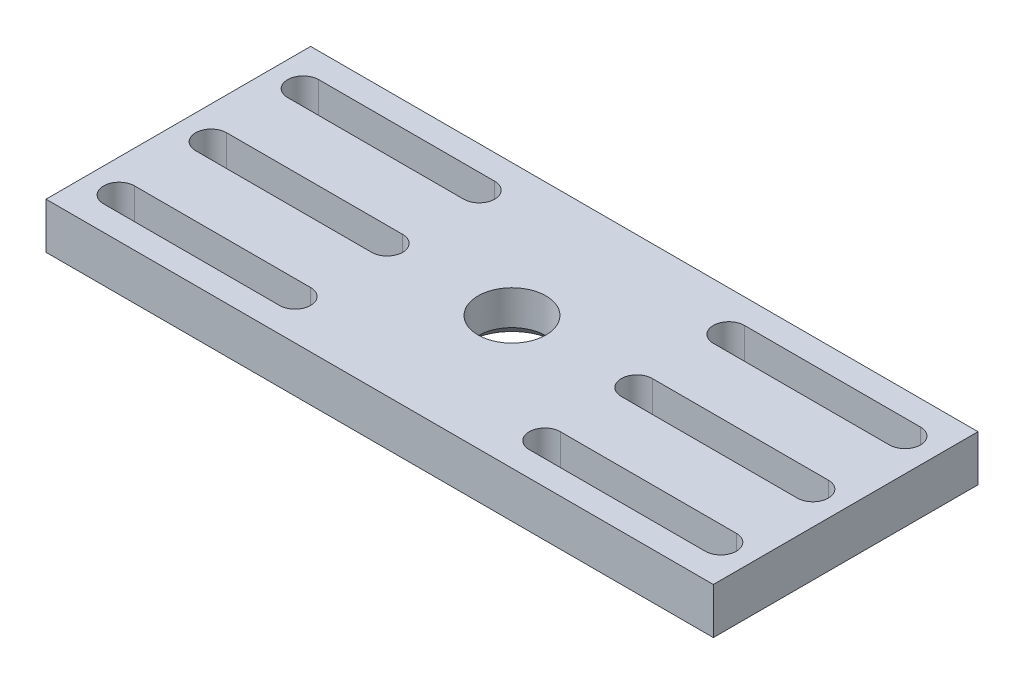
ISO-10303-21;
HEADER;
FILE_DESCRIPTION(('STEP AP214'),'2;1');
FILE_NAME('part.step','',(''),(''),'','','');
FILE_SCHEMA(('AUTOMOTIVE_DESIGN { 1 0 10303 214 1 1 1 1 }'));
ENDSEC;
DATA;
#1=APPLICATION_CONTEXT('core data for automotive mechanical design processes');
#2=APPLICATION_PROTOCOL_DEFINITION('international standard','automotive_design',2000,#1);
#3=PRODUCT_CONTEXT('',#1,'mechanical');
#4=PRODUCT('Part','Part','',(#3));
#5=PRODUCT_RELATED_PRODUCT_CATEGORY('part','',(#4));
#6=PRODUCT_DEFINITION_FORMATION('','',#4);
#7=PRODUCT_DEFINITION_CONTEXT('part definition',#1,'design');
#8=PRODUCT_DEFINITION('design','',#6,#7);
#9=PRODUCT_DEFINITION_SHAPE('','',#8);
#10=(LENGTH_UNIT() NAMED_UNIT(*) SI_UNIT(.MILLI.,.METRE.));
#11=(NAMED_UNIT(*) PLANE_ANGLE_UNIT() SI_UNIT($,.RADIAN.));
#12=(NAMED_UNIT(*) SI_UNIT($,.STERADIAN.) SOLID_ANGLE_UNIT());
#13=UNCERTAINTY_MEASURE_WITH_UNIT(LENGTH_MEASURE(1.E-05),#10,'distance_accuracy_value','');
#14=(GEOMETRIC_REPRESENTATION_CONTEXT(3) GLOBAL_UNCERTAINTY_ASSIGNED_CONTEXT((#13)) GLOBAL_UNIT_ASSIGNED_CONTEXT((#10,
#11,#12)) REPRESENTATION_CONTEXT('',''));
#15=CARTESIAN_POINT('',(0.,0.,0.));
#16=DIRECTION('',(0.,0.,1.));
#17=DIRECTION('',(1.,0.,0.));
#18=AXIS2_PLACEMENT_3D('',#15,#16,#17);
#19=CARTESIAN_POINT('',(145.,20.,57.5));
#20=DIRECTION('',(-1.,0.,0.));
#21=DIRECTION('',(0.,0.,1.));
#22=AXIS2_PLACEMENT_3D('',#19,#20,#21);
#23=PLANE('',#22);
#24=DIRECTION('',(0.,0.,-1.));
#25=VECTOR('',#24,1.);
#26=CARTESIAN_POINT('',(145.,0.,57.5));
#27=LINE('',#26,#25);
#28=CARTESIAN_POINT('',(145.,0.,57.5));
#29=VERTEX_POINT('',#28);
#30=CARTESIAN_POINT('',(145.,0.,-57.5));
#31=VERTEX_POINT('',#30);
#32=EDGE_CURVE('E494',#29,#31,#27,.T.);
#33=ORIENTED_EDGE('',*,*,#32,.T.);
#34=DIRECTION('',(0.,-1.,0.));
#35=VECTOR('',#34,1.);
#36=CARTESIAN_POINT('',(145.,20.,-57.5));
#37=LINE('',#36,#35);
#38=CARTESIAN_POINT('',(145.,20.,-57.5));
#39=VERTEX_POINT('',#38);
#40=EDGE_CURVE('E541',#39,#31,#37,.T.);
#41=ORIENTED_EDGE('',*,*,#40,.F.);
#42=DIRECTION('',(0.,0.,-1.));
#43=VECTOR('',#42,1.);
#44=CARTESIAN_POINT('',(145.,20.,57.5));
#45=LINE('',#44,#43);
#46=CARTESIAN_POINT('',(145.,20.,57.5));
#47=VERTEX_POINT('',#46);
#48=EDGE_CURVE('E504',#47,#39,#45,.T.);
#49=ORIENTED_EDGE('',*,*,#48,.F.);
#50=DIRECTION('',(0.,-1.,0.));
#51=VECTOR('',#50,1.);
#52=CARTESIAN_POINT('',(145.,20.,57.5));
#53=LINE('',#52,#51);
#54=EDGE_CURVE('E518',#47,#29,#53,.T.);
#55=ORIENTED_EDGE('',*,*,#54,.T.);
#56=EDGE_LOOP('',(#33,#41,#49,#55));
#57=FACE_BOUND('',#56,.T.);
#58=ADVANCED_FACE('F41',(#57),#23,.F.);
#59=CARTESIAN_POINT('',(-145.,20.,-57.5));
#60=DIRECTION('',(0.,0.,1.));
#61=DIRECTION('',(1.,0.,0.));
#62=AXIS2_PLACEMENT_3D('',#59,#60,#61);
#63=PLANE('',#62);
#64=DIRECTION('',(-1.,0.,0.));
#65=VECTOR('',#64,1.);
#66=CARTESIAN_POINT('',(-145.,0.,-57.5));
#67=LINE('',#66,#65);
#68=CARTESIAN_POINT('',(-145.,0.,-57.5));
#69=VERTEX_POINT('',#68);
#70=EDGE_CURVE('E522',#31,#69,#67,.T.);
#71=ORIENTED_EDGE('',*,*,#70,.T.);
#72=DIRECTION('',(0.,-1.,0.));
#73=VECTOR('',#72,1.);
#74=CARTESIAN_POINT('',(-145.,20.,-57.5));
#75=LINE('',#74,#73);
#76=CARTESIAN_POINT('',(-145.,20.,-57.5));
#77=VERTEX_POINT('',#76);
#78=EDGE_CURVE('E537',#77,#69,#75,.T.);
#79=ORIENTED_EDGE('',*,*,#78,.F.);
#80=DIRECTION('',(-1.,0.,0.));
#81=VECTOR('',#80,1.);
#82=CARTESIAN_POINT('',(-145.,20.,-57.5));
#83=LINE('',#82,#81);
#84=EDGE_CURVE('E508',#39,#77,#83,.T.);
#85=ORIENTED_EDGE('',*,*,#84,.F.);
#86=ORIENTED_EDGE('',*,*,#40,.T.);
#87=EDGE_LOOP('',(#71,#79,#85,#86));
#88=FACE_BOUND('',#87,.T.);
#89=ADVANCED_FACE('F561',(#88),#63,.F.);
#90=CARTESIAN_POINT('',(-145.,20.,57.5));
#91=DIRECTION('',(1.,0.,0.));
#92=DIRECTION('',(0.,0.,-1.));
#93=AXIS2_PLACEMENT_3D('',#90,#91,#92);
#94=PLANE('',#93);
#95=DIRECTION('',(0.,0.,1.));
#96=VECTOR('',#95,1.);
#97=CARTESIAN_POINT('',(-145.,0.,57.5));
#98=LINE('',#97,#96);
#99=CARTESIAN_POINT('',(-145.,0.,57.5));
#100=VERTEX_POINT('',#99);
#101=EDGE_CURVE('E525',#69,#100,#98,.T.);
#102=ORIENTED_EDGE('',*,*,#101,.T.);
#103=DIRECTION('',(0.,-1.,0.));
#104=VECTOR('',#103,1.);
#105=CARTESIAN_POINT('',(-145.,20.,57.5));
#106=LINE('',#105,#104);
#107=CARTESIAN_POINT('',(-145.,20.,57.5));
#108=VERTEX_POINT('',#107);
#109=EDGE_CURVE('E533',#108,#100,#106,.T.);
#110=ORIENTED_EDGE('',*,*,#109,.F.);
#111=DIRECTION('',(0.,0.,1.));
#112=VECTOR('',#111,1.);
#113=CARTESIAN_POINT('',(-145.,20.,57.5));
#114=LINE('',#113,#112);
#115=EDGE_CURVE('E512',#77,#108,#114,.T.);
#116=ORIENTED_EDGE('',*,*,#115,.F.);
#117=ORIENTED_EDGE('',*,*,#78,.T.);
#118=EDGE_LOOP('',(#102,#110,#116,#117));
#119=FACE_BOUND('',#118,.T.);
#120=ADVANCED_FACE('F566',(#119),#94,.F.);
#121=CARTESIAN_POINT('',(-145.,20.,57.5));
#122=DIRECTION('',(0.,0.,-1.));
#123=DIRECTION('',(-1.,0.,0.));
#124=AXIS2_PLACEMENT_3D('',#121,#122,#123);
#125=PLANE('',#124);
#126=DIRECTION('',(1.,0.,0.));
#127=VECTOR('',#126,1.);
#128=CARTESIAN_POINT('',(-145.,0.,57.5));
#129=LINE('',#128,#127);
#130=EDGE_CURVE('E509',#100,#29,#129,.T.);
#131=ORIENTED_EDGE('',*,*,#130,.T.);
#132=ORIENTED_EDGE('',*,*,#54,.F.);
#133=DIRECTION('',(1.,0.,0.));
#134=VECTOR('',#133,1.);
#135=CARTESIAN_POINT('',(-145.,20.,57.5));
#136=LINE('',#135,#134);
#137=EDGE_CURVE('E515',#108,#47,#136,.T.);
#138=ORIENTED_EDGE('',*,*,#137,.F.);
#139=ORIENTED_EDGE('',*,*,#109,.T.);
#140=EDGE_LOOP('',(#131,#132,#138,#139));
#141=FACE_BOUND('',#140,.T.);
#142=ADVANCED_FACE('F572',(#141),#125,.F.);
#143=CARTESIAN_POINT('',(0.,20.,0.));
#144=DIRECTION('',(0.,-1.,0.));
#145=DIRECTION('',(0.,0.,-1.));
#146=AXIS2_PLACEMENT_3D('',#143,#144,#145);
#147=PLANE('',#146);
#148=DIRECTION('',(1.,0.,0.));
#149=VECTOR('',#148,1.);
#150=CARTESIAN_POINT('',(-130.75,20.,-33.25));
#151=LINE('',#150,#149);
#152=CARTESIAN_POINT('',(-130.75,20.,-33.25));
#153=VERTEX_POINT('',#152);
#154=CARTESIAN_POINT('',(-54.25,20.,-33.25));
#155=VERTEX_POINT('',#154);
#156=EDGE_CURVE('E308',#153,#155,#151,.T.);
#157=ORIENTED_EDGE('',*,*,#156,.F.);
#158=CARTESIAN_POINT('',(-130.75,20.,-40.));
#159=DIRECTION('',(0.,1.,0.));
#160=DIRECTION('',(0.,0.,1.));
#161=AXIS2_PLACEMENT_3D('',#158,#159,#160);
#162=CIRCLE('',#161,6.75);
#163=CARTESIAN_POINT('',(-130.75,20.,-46.75));
#164=VERTEX_POINT('',#163);
#165=EDGE_CURVE('E58',#164,#153,#162,.T.);
#166=ORIENTED_EDGE('',*,*,#165,.F.);
#167=DIRECTION('',(-1.,0.,0.));
#168=VECTOR('',#167,1.);
#169=CARTESIAN_POINT('',(-130.75,20.,-46.75));
#170=LINE('',#169,#168);
#171=CARTESIAN_POINT('',(-54.25,20.,-46.75));
#172=VERTEX_POINT('',#171);
#173=EDGE_CURVE('E293',#172,#164,#170,.T.);
#174=ORIENTED_EDGE('',*,*,#173,.F.);
#175=CARTESIAN_POINT('',(-54.25,20.,-40.));
#176=DIRECTION('',(0.,1.,0.));
#177=DIRECTION('',(0.,0.,1.));
#178=AXIS2_PLACEMENT_3D('',#175,#176,#177);
#179=CIRCLE('',#178,6.75);
#180=EDGE_CURVE('E313',#155,#172,#179,.T.);
#181=ORIENTED_EDGE('',*,*,#180,.F.);
#182=EDGE_LOOP('',(#157,#166,#174,#181));
#183=FACE_BOUND('',#182,.T.);
#184=DIRECTION('',(1.,0.,0.));
#185=VECTOR('',#184,1.);
#186=CARTESIAN_POINT('',(-130.75,20.,46.75));
#187=LINE('',#186,#185);
#188=CARTESIAN_POINT('',(-130.75,20.,46.75));
#189=VERTEX_POINT('',#188);
#190=CARTESIAN_POINT('',(-54.25,20.,46.75));
#191=VERTEX_POINT('',#190);
#192=EDGE_CURVE('E352',#189,#191,#187,.T.);
#193=ORIENTED_EDGE('',*,*,#192,.F.);
#194=CARTESIAN_POINT('',(-130.75,20.,40.));
#195=DIRECTION('',(0.,1.,0.));
#196=DIRECTION('',(0.,0.,1.));
#197=AXIS2_PLACEMENT_3D('',#194,#195,#196);
#198=CIRCLE('',#197,6.75);
#199=CARTESIAN_POINT('',(-130.75,20.,33.25));
#200=VERTEX_POINT('',#199);
#201=EDGE_CURVE('E66',#200,#189,#198,.T.);
#202=ORIENTED_EDGE('',*,*,#201,.F.);
#203=DIRECTION('',(-1.,0.,0.));
#204=VECTOR('',#203,1.);
#205=CARTESIAN_POINT('',(-130.75,20.,33.25));
#206=LINE('',#205,#204);
#207=CARTESIAN_POINT('',(-54.25,20.,33.25));
#208=VERTEX_POINT('',#207);
#209=EDGE_CURVE('E337',#208,#200,#206,.T.);
#210=ORIENTED_EDGE('',*,*,#209,.F.);
#211=CARTESIAN_POINT('',(-54.25,20.,40.));
#212=DIRECTION('',(0.,1.,0.));
#213=DIRECTION('',(0.,0.,1.));
#214=AXIS2_PLACEMENT_3D('',#211,#212,#213);
#215=CIRCLE('',#214,6.75);
#216=EDGE_CURVE('E357',#191,#208,#215,.T.);
#217=ORIENTED_EDGE('',*,*,#216,.F.);
#218=EDGE_LOOP('',(#193,#202,#210,#217));
#219=FACE_BOUND('',#218,.T.);
#220=DIRECTION('',(1.,0.,0.));
#221=VECTOR('',#220,1.);
#222=CARTESIAN_POINT('',(54.25,20.,6.75));
#223=LINE('',#222,#221);
#224=CARTESIAN_POINT('',(54.25,20.,6.75));
#225=VERTEX_POINT('',#224);
#226=CARTESIAN_POINT('',(130.75,20.,6.75));
#227=VERTEX_POINT('',#226);
#228=EDGE_CURVE('E395',#225,#227,#223,.T.);
#229=ORIENTED_EDGE('',*,*,#228,.F.);
#230=CARTESIAN_POINT('',(54.25,20.,0.));
#231=DIRECTION('',(0.,1.,0.));
#232=DIRECTION('',(0.,0.,1.));
#233=AXIS2_PLACEMENT_3D('',#230,#231,#232);
#234=CIRCLE('',#233,6.75);
#235=CARTESIAN_POINT('',(54.25,20.,-6.75));
#236=VERTEX_POINT('',#235);
#237=EDGE_CURVE('E392',#236,#225,#234,.T.);
#238=ORIENTED_EDGE('',*,*,#237,.F.);
#239=DIRECTION('',(-1.,0.,0.));
#240=VECTOR('',#239,1.);
#241=CARTESIAN_POINT('',(54.25,20.,-6.75));
#242=LINE('',#241,#240);
#243=CARTESIAN_POINT('',(130.75,20.,-6.75));
#244=VERTEX_POINT('',#243);
#245=EDGE_CURVE('E379',#244,#236,#242,.T.);
#246=ORIENTED_EDGE('',*,*,#245,.F.);
#247=CARTESIAN_POINT('',(130.75,20.,0.));
#248=DIRECTION('',(0.,1.,0.));
#249=DIRECTION('',(0.,0.,1.));
#250=AXIS2_PLACEMENT_3D('',#247,#248,#249);
#251=CIRCLE('',#250,6.75);
#252=EDGE_CURVE('E400',#227,#244,#251,.T.);
#253=ORIENTED_EDGE('',*,*,#252,.F.);
#254=EDGE_LOOP('',(#229,#238,#246,#253));
#255=FACE_BOUND('',#254,.T.);
#256=DIRECTION('',(1.,0.,0.));
#257=VECTOR('',#256,1.);
#258=CARTESIAN_POINT('',(54.25,20.,46.75));
#259=LINE('',#258,#257);
#260=CARTESIAN_POINT('',(54.25,20.,46.75));
#261=VERTEX_POINT('',#260);
#262=CARTESIAN_POINT('',(130.75,20.,46.75));
#263=VERTEX_POINT('',#262);
#264=EDGE_CURVE('E438',#261,#263,#259,.T.);
#265=ORIENTED_EDGE('',*,*,#264,.F.);
#266=CARTESIAN_POINT('',(54.25,20.,40.));
#267=DIRECTION('',(0.,1.,0.));
#268=DIRECTION('',(0.,0.,1.));
#269=AXIS2_PLACEMENT_3D('',#266,#267,#268);
#270=CIRCLE('',#269,6.75);
#271=CARTESIAN_POINT('',(54.25,20.,33.25));
#272=VERTEX_POINT('',#271);
#273=EDGE_CURVE('E279',#272,#261,#270,.T.);
#274=ORIENTED_EDGE('',*,*,#273,.F.);
#275=DIRECTION('',(-1.,0.,0.));
#276=VECTOR('',#275,1.);
#277=CARTESIAN_POINT('',(54.25,20.,33.25));
#278=LINE('',#277,#276);
#279=CARTESIAN_POINT('',(130.75,20.,33.25));
#280=VERTEX_POINT('',#279);
#281=EDGE_CURVE('E423',#280,#272,#278,.T.);
#282=ORIENTED_EDGE('',*,*,#281,.F.);
#283=CARTESIAN_POINT('',(130.75,20.,40.));
#284=DIRECTION('',(0.,1.,0.));
#285=DIRECTION('',(0.,0.,1.));
#286=AXIS2_PLACEMENT_3D('',#283,#284,#285);
#287=CIRCLE('',#286,6.75);
#288=EDGE_CURVE('E442',#263,#280,#287,.T.);
#289=ORIENTED_EDGE('',*,*,#288,.F.);
#290=EDGE_LOOP('',(#265,#274,#282,#289));
#291=FACE_BOUND('',#290,.T.);
#292=DIRECTION('',(1.,0.,0.));
#293=VECTOR('',#292,1.);
#294=CARTESIAN_POINT('',(54.25,20.,-33.25));
#295=LINE('',#294,#293);
#296=CARTESIAN_POINT('',(54.25,20.,-33.25));
#297=VERTEX_POINT('',#296);
#298=CARTESIAN_POINT('',(130.75,20.,-33.25));
#299=VERTEX_POINT('',#298);
#300=EDGE_CURVE('E269',#297,#299,#295,.T.);
#301=ORIENTED_EDGE('',*,*,#300,.F.);
#302=CARTESIAN_POINT('',(54.25,20.,-40.));
#303=DIRECTION('',(0.,1.,0.));
#304=DIRECTION('',(0.,0.,1.));
#305=AXIS2_PLACEMENT_3D('',#302,#303,#304);
#306=CIRCLE('',#305,6.75);
#307=CARTESIAN_POINT('',(54.25,20.,-46.75));
#308=VERTEX_POINT('',#307);
#309=EDGE_CURVE('E235',#308,#297,#306,.T.);
#310=ORIENTED_EDGE('',*,*,#309,.F.);
#311=DIRECTION('',(-1.,0.,0.));
#312=VECTOR('',#311,1.);
#313=CARTESIAN_POINT('',(54.25,20.,-46.75));
#314=LINE('',#313,#312);
#315=CARTESIAN_POINT('',(130.75,20.,-46.75));
#316=VERTEX_POINT('',#315);
#317=EDGE_CURVE('E256',#316,#308,#314,.T.);
#318=ORIENTED_EDGE('',*,*,#317,.F.);
#319=CARTESIAN_POINT('',(130.75,20.,-40.));
#320=DIRECTION('',(0.,1.,0.));
#321=DIRECTION('',(0.,0.,1.));
#322=AXIS2_PLACEMENT_3D('',#319,#320,#321);
#323=CIRCLE('',#322,6.75);
#324=EDGE_CURVE('E260',#299,#316,#323,.T.);
#325=ORIENTED_EDGE('',*,*,#324,.F.);
#326=EDGE_LOOP('',(#301,#310,#318,#325));
#327=FACE_BOUND('',#326,.T.);
#328=CARTESIAN_POINT('',(0.,20.,0.));
#329=DIRECTION('',(0.,1.,0.));
#330=DIRECTION('',(0.,0.,1.));
#331=AXIS2_PLACEMENT_3D('',#328,#329,#330);
#332=CIRCLE('',#331,14.75);
#333=CARTESIAN_POINT('',(0.,20.,14.75));
#334=VERTEX_POINT('',#333);
#335=EDGE_CURVE('E270',#334,#334,#332,.T.);
#336=ORIENTED_EDGE('',*,*,#335,.F.);
#337=EDGE_LOOP('',(#336));
#338=FACE_BOUND('',#337,.T.);
#339=DIRECTION('',(1.,0.,0.));
#340=VECTOR('',#339,1.);
#341=CARTESIAN_POINT('',(-130.75,20.,6.75));
#342=LINE('',#341,#340);
#343=CARTESIAN_POINT('',(-130.75,20.,6.75));
#344=VERTEX_POINT('',#343);
#345=CARTESIAN_POINT('',(-54.25,20.,6.75));
#346=VERTEX_POINT('',#345);
#347=EDGE_CURVE('E480',#344,#346,#342,.T.);
#348=ORIENTED_EDGE('',*,*,#347,.F.);
#349=CARTESIAN_POINT('',(-130.75,20.,0.));
#350=DIRECTION('',(0.,1.,0.));
#351=DIRECTION('',(0.,0.,1.));
#352=AXIS2_PLACEMENT_3D('',#349,#350,#351);
#353=CIRCLE('',#352,6.75);
#354=CARTESIAN_POINT('',(-130.75,20.,-6.75));
#355=VERTEX_POINT('',#354);
#356=EDGE_CURVE('E323',#355,#344,#353,.T.);
#357=ORIENTED_EDGE('',*,*,#356,.F.);
#358=DIRECTION('',(-1.,0.,0.));
#359=VECTOR('',#358,1.);
#360=CARTESIAN_POINT('',(-130.75,20.,-6.75));
#361=LINE('',#360,#359);
#362=CARTESIAN_POINT('',(-54.25,20.,-6.75));
#363=VERTEX_POINT('',#362);
#364=EDGE_CURVE('E465',#363,#355,#361,.T.);
#365=ORIENTED_EDGE('',*,*,#364,.F.);
#366=CARTESIAN_POINT('',(-54.25,20.,0.));
#367=DIRECTION('',(0.,1.,0.));
#368=DIRECTION('',(0.,0.,1.));
#369=AXIS2_PLACEMENT_3D('',#366,#367,#368);
#370=CIRCLE('',#369,6.75);
#371=EDGE_CURVE('E484',#346,#363,#370,.T.);
#372=ORIENTED_EDGE('',*,*,#371,.F.);
#373=EDGE_LOOP('',(#348,#357,#365,#372));
#374=FACE_BOUND('',#373,.T.);
#375=ORIENTED_EDGE('',*,*,#48,.T.);
#376=ORIENTED_EDGE('',*,*,#84,.T.);
#377=ORIENTED_EDGE('',*,*,#115,.T.);
#378=ORIENTED_EDGE('',*,*,#137,.T.);
#379=EDGE_LOOP('',(#375,#376,#377,#378));
#380=FACE_BOUND('',#379,.T.);
#381=ADVANCED_FACE('F576',(#183,#219,#255,#291,#327,#338,#374,#380),#147,.F.);
#382=CARTESIAN_POINT('',(0.,0.,0.));
#383=DIRECTION('',(0.,-1.,0.));
#384=DIRECTION('',(0.,0.,-1.));
#385=AXIS2_PLACEMENT_3D('',#382,#383,#384);
#386=PLANE('',#385);
#387=CARTESIAN_POINT('',(0.,0.,0.));
#388=DIRECTION('',(0.,-1.,0.));
#389=DIRECTION('',(0.,0.,-1.));
#390=AXIS2_PLACEMENT_3D('',#387,#388,#389);
#391=CIRCLE('',#390,19.7500000000001);
#392=CARTESIAN_POINT('',(0.,0.,-19.7500000000001));
#393=VERTEX_POINT('',#392);
#394=EDGE_CURVE('E51',#393,#393,#391,.F.);
#395=ORIENTED_EDGE('',*,*,#394,.T.);
#396=EDGE_LOOP('',(#395));
#397=FACE_BOUND('',#396,.T.);
#398=CARTESIAN_POINT('',(-130.75,0.,-40.));
#399=DIRECTION('',(0.,1.,0.));
#400=DIRECTION('',(0.,0.,1.));
#401=AXIS2_PLACEMENT_3D('',#398,#399,#400);
#402=CIRCLE('',#401,6.75);
#403=CARTESIAN_POINT('',(-130.75,0.,-46.75));
#404=VERTEX_POINT('',#403);
#405=CARTESIAN_POINT('',(-130.75,0.,-33.25));
#406=VERTEX_POINT('',#405);
#407=EDGE_CURVE('E288',#404,#406,#402,.T.);
#408=ORIENTED_EDGE('',*,*,#407,.T.);
#409=DIRECTION('',(1.,0.,0.));
#410=VECTOR('',#409,1.);
#411=CARTESIAN_POINT('',(-130.75,0.,-33.25));
#412=LINE('',#411,#410);
#413=CARTESIAN_POINT('',(-54.25,0.,-33.25));
#414=VERTEX_POINT('',#413);
#415=EDGE_CURVE('E292',#406,#414,#412,.T.);
#416=ORIENTED_EDGE('',*,*,#415,.T.);
#417=CARTESIAN_POINT('',(-54.25,0.,-40.));
#418=DIRECTION('',(0.,1.,0.));
#419=DIRECTION('',(0.,0.,1.));
#420=AXIS2_PLACEMENT_3D('',#417,#418,#419);
#421=CIRCLE('',#420,6.75);
#422=CARTESIAN_POINT('',(-54.25,0.,-46.75));
#423=VERTEX_POINT('',#422);
#424=EDGE_CURVE('E297',#414,#423,#421,.T.);
#425=ORIENTED_EDGE('',*,*,#424,.T.);
#426=DIRECTION('',(-1.,0.,0.));
#427=VECTOR('',#426,1.);
#428=CARTESIAN_POINT('',(-130.75,0.,-46.75));
#429=LINE('',#428,#427);
#430=EDGE_CURVE('E301',#423,#404,#429,.T.);
#431=ORIENTED_EDGE('',*,*,#430,.T.);
#432=EDGE_LOOP('',(#408,#416,#425,#431));
#433=FACE_BOUND('',#432,.T.);
#434=CARTESIAN_POINT('',(-130.75,0.,40.));
#435=DIRECTION('',(0.,1.,0.));
#436=DIRECTION('',(0.,0.,1.));
#437=AXIS2_PLACEMENT_3D('',#434,#435,#436);
#438=CIRCLE('',#437,6.75);
#439=CARTESIAN_POINT('',(-130.75,0.,33.25));
#440=VERTEX_POINT('',#439);
#441=CARTESIAN_POINT('',(-130.75,0.,46.75));
#442=VERTEX_POINT('',#441);
#443=EDGE_CURVE('E332',#440,#442,#438,.T.);
#444=ORIENTED_EDGE('',*,*,#443,.T.);
#445=DIRECTION('',(1.,0.,0.));
#446=VECTOR('',#445,1.);
#447=CARTESIAN_POINT('',(-130.75,0.,46.75));
#448=LINE('',#447,#446);
#449=CARTESIAN_POINT('',(-54.25,0.,46.75));
#450=VERTEX_POINT('',#449);
#451=EDGE_CURVE('E336',#442,#450,#448,.T.);
#452=ORIENTED_EDGE('',*,*,#451,.T.);
#453=CARTESIAN_POINT('',(-54.25,0.,40.));
#454=DIRECTION('',(0.,1.,0.));
#455=DIRECTION('',(0.,0.,1.));
#456=AXIS2_PLACEMENT_3D('',#453,#454,#455);
#457=CIRCLE('',#456,6.75);
#458=CARTESIAN_POINT('',(-54.25,0.,33.25));
#459=VERTEX_POINT('',#458);
#460=EDGE_CURVE('E341',#450,#459,#457,.T.);
#461=ORIENTED_EDGE('',*,*,#460,.T.);
#462=DIRECTION('',(-1.,0.,0.));
#463=VECTOR('',#462,1.);
#464=CARTESIAN_POINT('',(-130.75,0.,33.25));
#465=LINE('',#464,#463);
#466=EDGE_CURVE('E345',#459,#440,#465,.T.);
#467=ORIENTED_EDGE('',*,*,#466,.T.);
#468=EDGE_LOOP('',(#444,#452,#461,#467));
#469=FACE_BOUND('',#468,.T.);
#470=CARTESIAN_POINT('',(54.25,0.,0.));
#471=DIRECTION('',(0.,1.,0.));
#472=DIRECTION('',(0.,0.,1.));
#473=AXIS2_PLACEMENT_3D('',#470,#471,#472);
#474=CIRCLE('',#473,6.75);
#475=CARTESIAN_POINT('',(54.25,0.,-6.75));
#476=VERTEX_POINT('',#475);
#477=CARTESIAN_POINT('',(54.25,0.,6.75));
#478=VERTEX_POINT('',#477);
#479=EDGE_CURVE('E374',#476,#478,#474,.T.);
#480=ORIENTED_EDGE('',*,*,#479,.T.);
#481=DIRECTION('',(1.,0.,0.));
#482=VECTOR('',#481,1.);
#483=CARTESIAN_POINT('',(54.25,0.,6.75));
#484=LINE('',#483,#482);
#485=CARTESIAN_POINT('',(130.75,0.,6.75));
#486=VERTEX_POINT('',#485);
#487=EDGE_CURVE('E378',#478,#486,#484,.T.);
#488=ORIENTED_EDGE('',*,*,#487,.T.);
#489=CARTESIAN_POINT('',(130.75,0.,0.));
#490=DIRECTION('',(0.,1.,0.));
#491=DIRECTION('',(0.,0.,1.));
#492=AXIS2_PLACEMENT_3D('',#489,#490,#491);
#493=CIRCLE('',#492,6.75);
#494=CARTESIAN_POINT('',(130.75,0.,-6.75));
#495=VERTEX_POINT('',#494);
#496=EDGE_CURVE('E383',#486,#495,#493,.T.);
#497=ORIENTED_EDGE('',*,*,#496,.T.);
#498=DIRECTION('',(-1.,0.,0.));
#499=VECTOR('',#498,1.);
#500=CARTESIAN_POINT('',(54.25,0.,-6.75));
#501=LINE('',#500,#499);
#502=EDGE_CURVE('E387',#495,#476,#501,.T.);
#503=ORIENTED_EDGE('',*,*,#502,.T.);
#504=EDGE_LOOP('',(#480,#488,#497,#503));
#505=FACE_BOUND('',#504,.T.);
#506=CARTESIAN_POINT('',(54.25,0.,40.));
#507=DIRECTION('',(0.,1.,0.));
#508=DIRECTION('',(0.,0.,1.));
#509=AXIS2_PLACEMENT_3D('',#506,#507,#508);
#510=CIRCLE('',#509,6.75);
#511=CARTESIAN_POINT('',(54.25,0.,33.25));
#512=VERTEX_POINT('',#511);
#513=CARTESIAN_POINT('',(54.25,0.,46.75));
#514=VERTEX_POINT('',#513);
#515=EDGE_CURVE('E418',#512,#514,#510,.T.);
#516=ORIENTED_EDGE('',*,*,#515,.T.);
#517=DIRECTION('',(1.,0.,0.));
#518=VECTOR('',#517,1.);
#519=CARTESIAN_POINT('',(54.25,0.,46.75));
#520=LINE('',#519,#518);
#521=CARTESIAN_POINT('',(130.75,0.,46.75));
#522=VERTEX_POINT('',#521);
#523=EDGE_CURVE('E422',#514,#522,#520,.T.);
#524=ORIENTED_EDGE('',*,*,#523,.T.);
#525=CARTESIAN_POINT('',(130.75,0.,40.));
#526=DIRECTION('',(0.,1.,0.));
#527=DIRECTION('',(0.,0.,1.));
#528=AXIS2_PLACEMENT_3D('',#525,#526,#527);
#529=CIRCLE('',#528,6.75);
#530=CARTESIAN_POINT('',(130.75,0.,33.25));
#531=VERTEX_POINT('',#530);
#532=EDGE_CURVE('E427',#522,#531,#529,.T.);
#533=ORIENTED_EDGE('',*,*,#532,.T.);
#534=DIRECTION('',(-1.,0.,0.));
#535=VECTOR('',#534,1.);
#536=CARTESIAN_POINT('',(54.25,0.,33.25));
#537=LINE('',#536,#535);
#538=EDGE_CURVE('E431',#531,#512,#537,.T.);
#539=ORIENTED_EDGE('',*,*,#538,.T.);
#540=EDGE_LOOP('',(#516,#524,#533,#539));
#541=FACE_BOUND('',#540,.T.);
#542=CARTESIAN_POINT('',(54.25,0.,-40.));
#543=DIRECTION('',(0.,1.,0.));
#544=DIRECTION('',(0.,0.,1.));
#545=AXIS2_PLACEMENT_3D('',#542,#543,#544);
#546=CIRCLE('',#545,6.75);
#547=CARTESIAN_POINT('',(54.25,0.,-46.75));
#548=VERTEX_POINT('',#547);
#549=CARTESIAN_POINT('',(54.25,0.,-33.25));
#550=VERTEX_POINT('',#549);
#551=EDGE_CURVE('E232',#548,#550,#546,.T.);
#552=ORIENTED_EDGE('',*,*,#551,.T.);
#553=DIRECTION('',(1.,0.,0.));
#554=VECTOR('',#553,1.);
#555=CARTESIAN_POINT('',(54.25,0.,-33.25));
#556=LINE('',#555,#554);
#557=CARTESIAN_POINT('',(130.75,0.,-33.25));
#558=VERTEX_POINT('',#557);
#559=EDGE_CURVE('E245',#550,#558,#556,.T.);
#560=ORIENTED_EDGE('',*,*,#559,.T.);
#561=CARTESIAN_POINT('',(130.75,0.,-40.));
#562=DIRECTION('',(0.,1.,0.));
#563=DIRECTION('',(0.,0.,1.));
#564=AXIS2_PLACEMENT_3D('',#561,#562,#563);
#565=CIRCLE('',#564,6.75);
#566=CARTESIAN_POINT('',(130.75,0.,-46.75));
#567=VERTEX_POINT('',#566);
#568=EDGE_CURVE('E250',#558,#567,#565,.T.);
#569=ORIENTED_EDGE('',*,*,#568,.T.);
#570=DIRECTION('',(-1.,0.,0.));
#571=VECTOR('',#570,1.);
#572=CARTESIAN_POINT('',(54.25,0.,-46.75));
#573=LINE('',#572,#571);
#574=EDGE_CURVE('E241',#567,#548,#573,.T.);
#575=ORIENTED_EDGE('',*,*,#574,.T.);
#576=EDGE_LOOP('',(#552,#560,#569,#575));
#577=FACE_BOUND('',#576,.T.);
#578=CARTESIAN_POINT('',(-130.75,0.,0.));
#579=DIRECTION('',(0.,1.,0.));
#580=DIRECTION('',(0.,0.,1.));
#581=AXIS2_PLACEMENT_3D('',#578,#579,#580);
#582=CIRCLE('',#581,6.75);
#583=CARTESIAN_POINT('',(-130.75,0.,-6.75));
#584=VERTEX_POINT('',#583);
#585=CARTESIAN_POINT('',(-130.75,0.,6.75));
#586=VERTEX_POINT('',#585);
#587=EDGE_CURVE('E460',#584,#586,#582,.T.);
#588=ORIENTED_EDGE('',*,*,#587,.T.);
#589=DIRECTION('',(1.,0.,0.));
#590=VECTOR('',#589,1.);
#591=CARTESIAN_POINT('',(-130.75,0.,6.75));
#592=LINE('',#591,#590);
#593=CARTESIAN_POINT('',(-54.25,0.,6.75));
#594=VERTEX_POINT('',#593);
#595=EDGE_CURVE('E464',#586,#594,#592,.T.);
#596=ORIENTED_EDGE('',*,*,#595,.T.);
#597=CARTESIAN_POINT('',(-54.25,0.,0.));
#598=DIRECTION('',(0.,1.,0.));
#599=DIRECTION('',(0.,0.,1.));
#600=AXIS2_PLACEMENT_3D('',#597,#598,#599);
#601=CIRCLE('',#600,6.75);
#602=CARTESIAN_POINT('',(-54.25,0.,-6.75));
#603=VERTEX_POINT('',#602);
#604=EDGE_CURVE('E469',#594,#603,#601,.T.);
#605=ORIENTED_EDGE('',*,*,#604,.T.);
#606=DIRECTION('',(-1.,0.,0.));
#607=VECTOR('',#606,1.);
#608=CARTESIAN_POINT('',(-130.75,0.,-6.75));
#609=LINE('',#608,#607);
#610=EDGE_CURVE('E473',#603,#584,#609,.T.);
#611=ORIENTED_EDGE('',*,*,#610,.T.);
#612=EDGE_LOOP('',(#588,#596,#605,#611));
#613=FACE_BOUND('',#612,.T.);
#614=ORIENTED_EDGE('',*,*,#32,.F.);
#615=ORIENTED_EDGE('',*,*,#130,.F.);
#616=ORIENTED_EDGE('',*,*,#101,.F.);
#617=ORIENTED_EDGE('',*,*,#70,.F.);
#618=EDGE_LOOP('',(#614,#615,#616,#617));
#619=FACE_BOUND('',#618,.T.);
#620=ADVANCED_FACE('F252',(#397,#433,#469,#505,#541,#577,#613,#619),#386,.T.);
#621=CARTESIAN_POINT('',(-130.75,0.,0.));
#622=DIRECTION('',(0.,1.,0.));
#623=DIRECTION('',(0.,0.,1.));
#624=AXIS2_PLACEMENT_3D('',#621,#622,#623);
#625=CYLINDRICAL_SURFACE('',#624,6.75);
#626=ORIENTED_EDGE('',*,*,#356,.T.);
#627=DIRECTION('',(0.,1.,0.));
#628=VECTOR('',#627,1.);
#629=CARTESIAN_POINT('',(-130.75,0.,6.75));
#630=LINE('',#629,#628);
#631=EDGE_CURVE('E477',#586,#344,#630,.T.);
#632=ORIENTED_EDGE('',*,*,#631,.F.);
#633=ORIENTED_EDGE('',*,*,#587,.F.);
#634=DIRECTION('',(0.,1.,0.));
#635=VECTOR('',#634,1.);
#636=CARTESIAN_POINT('',(-130.75,0.,-6.75));
#637=LINE('',#636,#635);
#638=EDGE_CURVE('E491',#584,#355,#637,.T.);
#639=ORIENTED_EDGE('',*,*,#638,.T.);
#640=EDGE_LOOP('',(#626,#632,#633,#639));
#641=FACE_BOUND('',#640,.T.);
#642=ADVANCED_FACE('F580',(#641),#625,.F.);
#643=CARTESIAN_POINT('',(-130.75,0.,-6.75));
#644=DIRECTION('',(0.,0.,-1.));
#645=DIRECTION('',(-1.,0.,0.));
#646=AXIS2_PLACEMENT_3D('',#643,#644,#645);
#647=PLANE('',#646);
#648=ORIENTED_EDGE('',*,*,#364,.T.);
#649=ORIENTED_EDGE('',*,*,#638,.F.);
#650=ORIENTED_EDGE('',*,*,#610,.F.);
#651=DIRECTION('',(0.,1.,0.));
#652=VECTOR('',#651,1.);
#653=CARTESIAN_POINT('',(-54.25,0.,-6.75));
#654=LINE('',#653,#652);
#655=EDGE_CURVE('E495',#603,#363,#654,.T.);
#656=ORIENTED_EDGE('',*,*,#655,.T.);
#657=EDGE_LOOP('',(#648,#649,#650,#656));
#658=FACE_BOUND('',#657,.T.);
#659=ADVANCED_FACE('F586',(#658),#647,.F.);
#660=CARTESIAN_POINT('',(-54.25,0.,0.));
#661=DIRECTION('',(0.,1.,0.));
#662=DIRECTION('',(0.,0.,1.));
#663=AXIS2_PLACEMENT_3D('',#660,#661,#662);
#664=CYLINDRICAL_SURFACE('',#663,6.75);
#665=ORIENTED_EDGE('',*,*,#371,.T.);
#666=ORIENTED_EDGE('',*,*,#655,.F.);
#667=ORIENTED_EDGE('',*,*,#604,.F.);
#668=DIRECTION('',(0.,1.,0.));
#669=VECTOR('',#668,1.);
#670=CARTESIAN_POINT('',(-54.25,0.,6.75));
#671=LINE('',#670,#669);
#672=EDGE_CURVE('E498',#594,#346,#671,.T.);
#673=ORIENTED_EDGE('',*,*,#672,.T.);
#674=EDGE_LOOP('',(#665,#666,#667,#673));
#675=FACE_BOUND('',#674,.T.);
#676=ADVANCED_FACE('F592',(#675),#664,.F.);
#677=CARTESIAN_POINT('',(-130.75,0.,6.75));
#678=DIRECTION('',(0.,0.,1.));
#679=DIRECTION('',(1.,0.,0.));
#680=AXIS2_PLACEMENT_3D('',#677,#678,#679);
#681=PLANE('',#680);
#682=ORIENTED_EDGE('',*,*,#347,.T.);
#683=ORIENTED_EDGE('',*,*,#672,.F.);
#684=ORIENTED_EDGE('',*,*,#595,.F.);
#685=ORIENTED_EDGE('',*,*,#631,.T.);
#686=EDGE_LOOP('',(#682,#683,#684,#685));
#687=FACE_BOUND('',#686,.T.);
#688=ADVANCED_FACE('F588',(#687),#681,.F.);
#689=CARTESIAN_POINT('',(0.,0.,0.));
#690=DIRECTION('',(0.,1.,0.));
#691=DIRECTION('',(0.,0.,1.));
#692=AXIS2_PLACEMENT_3D('',#689,#690,#691);
#693=CYLINDRICAL_SURFACE('',#692,14.75);
#694=CARTESIAN_POINT('',(0.,5.0000000000001,0.));
#695=DIRECTION('',(0.,-1.,0.));
#696=DIRECTION('',(0.,0.,-1.));
#697=AXIS2_PLACEMENT_3D('',#694,#695,#696);
#698=CIRCLE('',#697,14.75);
#699=CARTESIAN_POINT('',(0.,5.0000000000001,-14.75));
#700=VERTEX_POINT('',#699);
#701=EDGE_CURVE('E11',#700,#700,#698,.T.);
#702=ORIENTED_EDGE('',*,*,#701,.T.);
#703=EDGE_LOOP('',(#702));
#704=FACE_BOUND('',#703,.T.);
#705=ORIENTED_EDGE('',*,*,#335,.T.);
#706=EDGE_LOOP('',(#705));
#707=FACE_BOUND('',#706,.T.);
#708=ADVANCED_FACE('F591',(#704,#707),#693,.F.);
#709=CARTESIAN_POINT('',(54.25,0.,-40.));
#710=DIRECTION('',(0.,1.,0.));
#711=DIRECTION('',(0.,0.,1.));
#712=AXIS2_PLACEMENT_3D('',#709,#710,#711);
#713=CYLINDRICAL_SURFACE('',#712,6.75);
#714=ORIENTED_EDGE('',*,*,#309,.T.);
#715=DIRECTION('',(0.,1.,0.));
#716=VECTOR('',#715,1.);
#717=CARTESIAN_POINT('',(54.25,0.,-33.25));
#718=LINE('',#717,#716);
#719=EDGE_CURVE('E228',#550,#297,#718,.T.);
#720=ORIENTED_EDGE('',*,*,#719,.F.);
#721=ORIENTED_EDGE('',*,*,#551,.F.);
#722=DIRECTION('',(0.,1.,0.));
#723=VECTOR('',#722,1.);
#724=CARTESIAN_POINT('',(54.25,0.,-46.75));
#725=LINE('',#724,#723);
#726=EDGE_CURVE('E276',#548,#308,#725,.T.);
#727=ORIENTED_EDGE('',*,*,#726,.T.);
#728=EDGE_LOOP('',(#714,#720,#721,#727));
#729=FACE_BOUND('',#728,.T.);
#730=ADVANCED_FACE('F230',(#729),#713,.F.);
#731=CARTESIAN_POINT('',(54.25,0.,-46.75));
#732=DIRECTION('',(0.,0.,-1.));
#733=DIRECTION('',(-1.,0.,0.));
#734=AXIS2_PLACEMENT_3D('',#731,#732,#733);
#735=PLANE('',#734);
#736=ORIENTED_EDGE('',*,*,#317,.T.);
#737=ORIENTED_EDGE('',*,*,#726,.F.);
#738=ORIENTED_EDGE('',*,*,#574,.F.);
#739=DIRECTION('',(0.,1.,0.));
#740=VECTOR('',#739,1.);
#741=CARTESIAN_POINT('',(130.75,0.,-46.75));
#742=LINE('',#741,#740);
#743=EDGE_CURVE('E280',#567,#316,#742,.T.);
#744=ORIENTED_EDGE('',*,*,#743,.T.);
#745=EDGE_LOOP('',(#736,#737,#738,#744));
#746=FACE_BOUND('',#745,.T.);
#747=ADVANCED_FACE('F662',(#746),#735,.F.);
#748=CARTESIAN_POINT('',(130.75,0.,-40.));
#749=DIRECTION('',(0.,1.,0.));
#750=DIRECTION('',(0.,0.,1.));
#751=AXIS2_PLACEMENT_3D('',#748,#749,#750);
#752=CYLINDRICAL_SURFACE('',#751,6.75);
#753=ORIENTED_EDGE('',*,*,#324,.T.);
#754=ORIENTED_EDGE('',*,*,#743,.F.);
#755=ORIENTED_EDGE('',*,*,#568,.F.);
#756=DIRECTION('',(0.,1.,0.));
#757=VECTOR('',#756,1.);
#758=CARTESIAN_POINT('',(130.75,0.,-33.25));
#759=LINE('',#758,#757);
#760=EDGE_CURVE('E240',#558,#299,#759,.T.);
#761=ORIENTED_EDGE('',*,*,#760,.T.);
#762=EDGE_LOOP('',(#753,#754,#755,#761));
#763=FACE_BOUND('',#762,.T.);
#764=ADVANCED_FACE('F665',(#763),#752,.F.);
#765=CARTESIAN_POINT('',(54.25,0.,-33.25));
#766=DIRECTION('',(0.,0.,1.));
#767=DIRECTION('',(1.,0.,0.));
#768=AXIS2_PLACEMENT_3D('',#765,#766,#767);
#769=PLANE('',#768);
#770=ORIENTED_EDGE('',*,*,#300,.T.);
#771=ORIENTED_EDGE('',*,*,#760,.F.);
#772=ORIENTED_EDGE('',*,*,#559,.F.);
#773=ORIENTED_EDGE('',*,*,#719,.T.);
#774=EDGE_LOOP('',(#770,#771,#772,#773));
#775=FACE_BOUND('',#774,.T.);
#776=ADVANCED_FACE('F246',(#775),#769,.F.);
#777=CARTESIAN_POINT('',(54.25,0.,40.));
#778=DIRECTION('',(0.,1.,0.));
#779=DIRECTION('',(0.,0.,1.));
#780=AXIS2_PLACEMENT_3D('',#777,#778,#779);
#781=CYLINDRICAL_SURFACE('',#780,6.75);
#782=ORIENTED_EDGE('',*,*,#273,.T.);
#783=DIRECTION('',(0.,1.,0.));
#784=VECTOR('',#783,1.);
#785=CARTESIAN_POINT('',(54.25,0.,46.75));
#786=LINE('',#785,#784);
#787=EDGE_CURVE('E435',#514,#261,#786,.T.);
#788=ORIENTED_EDGE('',*,*,#787,.F.);
#789=ORIENTED_EDGE('',*,*,#515,.F.);
#790=DIRECTION('',(0.,1.,0.));
#791=VECTOR('',#790,1.);
#792=CARTESIAN_POINT('',(54.25,0.,33.25));
#793=LINE('',#792,#791);
#794=EDGE_CURVE('E396',#512,#272,#793,.T.);
#795=ORIENTED_EDGE('',*,*,#794,.T.);
#796=EDGE_LOOP('',(#782,#788,#789,#795));
#797=FACE_BOUND('',#796,.T.);
#798=ADVANCED_FACE('F600',(#797),#781,.F.);
#799=CARTESIAN_POINT('',(54.25,0.,33.25));
#800=DIRECTION('',(0.,0.,-1.));
#801=DIRECTION('',(-1.,0.,0.));
#802=AXIS2_PLACEMENT_3D('',#799,#800,#801);
#803=PLANE('',#802);
#804=ORIENTED_EDGE('',*,*,#281,.T.);
#805=ORIENTED_EDGE('',*,*,#794,.F.);
#806=ORIENTED_EDGE('',*,*,#538,.F.);
#807=DIRECTION('',(0.,1.,0.));
#808=VECTOR('',#807,1.);
#809=CARTESIAN_POINT('',(130.75,0.,33.25));
#810=LINE('',#809,#808);
#811=EDGE_CURVE('E451',#531,#280,#810,.T.);
#812=ORIENTED_EDGE('',*,*,#811,.T.);
#813=EDGE_LOOP('',(#804,#805,#806,#812));
#814=FACE_BOUND('',#813,.T.);
#815=ADVANCED_FACE('F603',(#814),#803,.F.);
#816=CARTESIAN_POINT('',(130.75,0.,40.));
#817=DIRECTION('',(0.,1.,0.));
#818=DIRECTION('',(0.,0.,1.));
#819=AXIS2_PLACEMENT_3D('',#816,#817,#818);
#820=CYLINDRICAL_SURFACE('',#819,6.75);
#821=ORIENTED_EDGE('',*,*,#288,.T.);
#822=ORIENTED_EDGE('',*,*,#811,.F.);
#823=ORIENTED_EDGE('',*,*,#532,.F.);
#824=DIRECTION('',(0.,1.,0.));
#825=VECTOR('',#824,1.);
#826=CARTESIAN_POINT('',(130.75,0.,46.75));
#827=LINE('',#826,#825);
#828=EDGE_CURVE('E454',#522,#263,#827,.T.);
#829=ORIENTED_EDGE('',*,*,#828,.T.);
#830=EDGE_LOOP('',(#821,#822,#823,#829));
#831=FACE_BOUND('',#830,.T.);
#832=ADVANCED_FACE('F609',(#831),#820,.F.);
#833=CARTESIAN_POINT('',(54.25,0.,46.75));
#834=DIRECTION('',(0.,0.,1.));
#835=DIRECTION('',(1.,0.,0.));
#836=AXIS2_PLACEMENT_3D('',#833,#834,#835);
#837=PLANE('',#836);
#838=ORIENTED_EDGE('',*,*,#264,.T.);
#839=ORIENTED_EDGE('',*,*,#828,.F.);
#840=ORIENTED_EDGE('',*,*,#523,.F.);
#841=ORIENTED_EDGE('',*,*,#787,.T.);
#842=EDGE_LOOP('',(#838,#839,#840,#841));
#843=FACE_BOUND('',#842,.T.);
#844=ADVANCED_FACE('F605',(#843),#837,.F.);
#845=CARTESIAN_POINT('',(54.25,0.,0.));
#846=DIRECTION('',(0.,1.,0.));
#847=DIRECTION('',(0.,0.,1.));
#848=AXIS2_PLACEMENT_3D('',#845,#846,#847);
#849=CYLINDRICAL_SURFACE('',#848,6.75);
#850=ORIENTED_EDGE('',*,*,#237,.T.);
#851=DIRECTION('',(0.,1.,0.));
#852=VECTOR('',#851,1.);
#853=CARTESIAN_POINT('',(54.25,0.,6.75));
#854=LINE('',#853,#852);
#855=EDGE_CURVE('E391',#478,#225,#854,.T.);
#856=ORIENTED_EDGE('',*,*,#855,.F.);
#857=ORIENTED_EDGE('',*,*,#479,.F.);
#858=DIRECTION('',(0.,1.,0.));
#859=VECTOR('',#858,1.);
#860=CARTESIAN_POINT('',(54.25,0.,-6.75));
#861=LINE('',#860,#859);
#862=EDGE_CURVE('E353',#476,#236,#861,.T.);
#863=ORIENTED_EDGE('',*,*,#862,.T.);
#864=EDGE_LOOP('',(#850,#856,#857,#863));
#865=FACE_BOUND('',#864,.T.);
#866=ADVANCED_FACE('F608',(#865),#849,.F.);
#867=CARTESIAN_POINT('',(54.25,0.,-6.75));
#868=DIRECTION('',(0.,0.,-1.));
#869=DIRECTION('',(-1.,0.,0.));
#870=AXIS2_PLACEMENT_3D('',#867,#868,#869);
#871=PLANE('',#870);
#872=ORIENTED_EDGE('',*,*,#245,.T.);
#873=ORIENTED_EDGE('',*,*,#862,.F.);
#874=ORIENTED_EDGE('',*,*,#502,.F.);
#875=DIRECTION('',(0.,1.,0.));
#876=VECTOR('',#875,1.);
#877=CARTESIAN_POINT('',(130.75,0.,-6.75));
#878=LINE('',#877,#876);
#879=EDGE_CURVE('E409',#495,#244,#878,.T.);
#880=ORIENTED_EDGE('',*,*,#879,.T.);
#881=EDGE_LOOP('',(#872,#873,#874,#880));
#882=FACE_BOUND('',#881,.T.);
#883=ADVANCED_FACE('F619',(#882),#871,.F.);
#884=CARTESIAN_POINT('',(130.75,0.,0.));
#885=DIRECTION('',(0.,1.,0.));
#886=DIRECTION('',(0.,0.,1.));
#887=AXIS2_PLACEMENT_3D('',#884,#885,#886);
#888=CYLINDRICAL_SURFACE('',#887,6.75);
#889=ORIENTED_EDGE('',*,*,#252,.T.);
#890=ORIENTED_EDGE('',*,*,#879,.F.);
#891=ORIENTED_EDGE('',*,*,#496,.F.);
#892=DIRECTION('',(0.,1.,0.));
#893=VECTOR('',#892,1.);
#894=CARTESIAN_POINT('',(130.75,0.,6.75));
#895=LINE('',#894,#893);
#896=EDGE_CURVE('E412',#486,#227,#895,.T.);
#897=ORIENTED_EDGE('',*,*,#896,.T.);
#898=EDGE_LOOP('',(#889,#890,#891,#897));
#899=FACE_BOUND('',#898,.T.);
#900=ADVANCED_FACE('F625',(#899),#888,.F.);
#901=CARTESIAN_POINT('',(54.25,0.,6.75));
#902=DIRECTION('',(0.,0.,1.));
#903=DIRECTION('',(1.,0.,0.));
#904=AXIS2_PLACEMENT_3D('',#901,#902,#903);
#905=PLANE('',#904);
#906=ORIENTED_EDGE('',*,*,#228,.T.);
#907=ORIENTED_EDGE('',*,*,#896,.F.);
#908=ORIENTED_EDGE('',*,*,#487,.F.);
#909=ORIENTED_EDGE('',*,*,#855,.T.);
#910=EDGE_LOOP('',(#906,#907,#908,#909));
#911=FACE_BOUND('',#910,.T.);
#912=ADVANCED_FACE('F621',(#911),#905,.F.);
#913=CARTESIAN_POINT('',(-130.75,0.,40.));
#914=DIRECTION('',(0.,1.,0.));
#915=DIRECTION('',(0.,0.,1.));
#916=AXIS2_PLACEMENT_3D('',#913,#914,#915);
#917=CYLINDRICAL_SURFACE('',#916,6.75);
#918=ORIENTED_EDGE('',*,*,#201,.T.);
#919=DIRECTION('',(0.,1.,0.));
#920=VECTOR('',#919,1.);
#921=CARTESIAN_POINT('',(-130.75,0.,46.75));
#922=LINE('',#921,#920);
#923=EDGE_CURVE('E349',#442,#189,#922,.T.);
#924=ORIENTED_EDGE('',*,*,#923,.F.);
#925=ORIENTED_EDGE('',*,*,#443,.F.);
#926=DIRECTION('',(0.,1.,0.));
#927=VECTOR('',#926,1.);
#928=CARTESIAN_POINT('',(-130.75,0.,33.25));
#929=LINE('',#928,#927);
#930=EDGE_CURVE('E309',#440,#200,#929,.T.);
#931=ORIENTED_EDGE('',*,*,#930,.T.);
#932=EDGE_LOOP('',(#918,#924,#925,#931));
#933=FACE_BOUND('',#932,.T.);
#934=ADVANCED_FACE('F624',(#933),#917,.F.);
#935=CARTESIAN_POINT('',(-130.75,0.,33.25));
#936=DIRECTION('',(0.,0.,-1.));
#937=DIRECTION('',(-1.,0.,0.));
#938=AXIS2_PLACEMENT_3D('',#935,#936,#937);
#939=PLANE('',#938);
#940=ORIENTED_EDGE('',*,*,#209,.T.);
#941=ORIENTED_EDGE('',*,*,#930,.F.);
#942=ORIENTED_EDGE('',*,*,#466,.F.);
#943=DIRECTION('',(0.,1.,0.));
#944=VECTOR('',#943,1.);
#945=CARTESIAN_POINT('',(-54.25,0.,33.25));
#946=LINE('',#945,#944);
#947=EDGE_CURVE('E366',#459,#208,#946,.T.);
#948=ORIENTED_EDGE('',*,*,#947,.T.);
#949=EDGE_LOOP('',(#940,#941,#942,#948));
#950=FACE_BOUND('',#949,.T.);
#951=ADVANCED_FACE('F635',(#950),#939,.F.);
#952=CARTESIAN_POINT('',(-54.25,0.,40.));
#953=DIRECTION('',(0.,1.,0.));
#954=DIRECTION('',(0.,0.,1.));
#955=AXIS2_PLACEMENT_3D('',#952,#953,#954);
#956=CYLINDRICAL_SURFACE('',#955,6.75);
#957=ORIENTED_EDGE('',*,*,#216,.T.);
#958=ORIENTED_EDGE('',*,*,#947,.F.);
#959=ORIENTED_EDGE('',*,*,#460,.F.);
#960=DIRECTION('',(0.,1.,0.));
#961=VECTOR('',#960,1.);
#962=CARTESIAN_POINT('',(-54.25,0.,46.75));
#963=LINE('',#962,#961);
#964=EDGE_CURVE('E369',#450,#191,#963,.T.);
#965=ORIENTED_EDGE('',*,*,#964,.T.);
#966=EDGE_LOOP('',(#957,#958,#959,#965));
#967=FACE_BOUND('',#966,.T.);
#968=ADVANCED_FACE('F640',(#967),#956,.F.);
#969=CARTESIAN_POINT('',(-130.75,0.,46.75));
#970=DIRECTION('',(0.,0.,1.));
#971=DIRECTION('',(1.,0.,0.));
#972=AXIS2_PLACEMENT_3D('',#969,#970,#971);
#973=PLANE('',#972);
#974=ORIENTED_EDGE('',*,*,#192,.T.);
#975=ORIENTED_EDGE('',*,*,#964,.F.);
#976=ORIENTED_EDGE('',*,*,#451,.F.);
#977=ORIENTED_EDGE('',*,*,#923,.T.);
#978=EDGE_LOOP('',(#974,#975,#976,#977));
#979=FACE_BOUND('',#978,.T.);
#980=ADVANCED_FACE('F636',(#979),#973,.F.);
#981=CARTESIAN_POINT('',(-130.75,0.,-40.));
#982=DIRECTION('',(0.,1.,0.));
#983=DIRECTION('',(0.,0.,1.));
#984=AXIS2_PLACEMENT_3D('',#981,#982,#983);
#985=CYLINDRICAL_SURFACE('',#984,6.75);
#986=ORIENTED_EDGE('',*,*,#165,.T.);
#987=DIRECTION('',(0.,1.,0.));
#988=VECTOR('',#987,1.);
#989=CARTESIAN_POINT('',(-130.75,0.,-33.25));
#990=LINE('',#989,#988);
#991=EDGE_CURVE('E305',#406,#153,#990,.T.);
#992=ORIENTED_EDGE('',*,*,#991,.F.);
#993=ORIENTED_EDGE('',*,*,#407,.F.);
#994=DIRECTION('',(0.,1.,0.));
#995=VECTOR('',#994,1.);
#996=CARTESIAN_POINT('',(-130.75,0.,-46.75));
#997=LINE('',#996,#995);
#998=EDGE_CURVE('E320',#404,#164,#997,.T.);
#999=ORIENTED_EDGE('',*,*,#998,.T.);
#1000=EDGE_LOOP('',(#986,#992,#993,#999));
#1001=FACE_BOUND('',#1000,.T.);
#1002=ADVANCED_FACE('F639',(#1001),#985,.F.);
#1003=CARTESIAN_POINT('',(-130.75,0.,-46.75));
#1004=DIRECTION('',(0.,0.,-1.));
#1005=DIRECTION('',(-1.,0.,0.));
#1006=AXIS2_PLACEMENT_3D('',#1003,#1004,#1005);
#1007=PLANE('',#1006);
#1008=ORIENTED_EDGE('',*,*,#173,.T.);
#1009=ORIENTED_EDGE('',*,*,#998,.F.);
#1010=ORIENTED_EDGE('',*,*,#430,.F.);
#1011=DIRECTION('',(0.,1.,0.));
#1012=VECTOR('',#1011,1.);
#1013=CARTESIAN_POINT('',(-54.25,0.,-46.75));
#1014=LINE('',#1013,#1012);
#1015=EDGE_CURVE('E324',#423,#172,#1014,.T.);
#1016=ORIENTED_EDGE('',*,*,#1015,.T.);
#1017=EDGE_LOOP('',(#1008,#1009,#1010,#1016));
#1018=FACE_BOUND('',#1017,.T.);
#1019=ADVANCED_FACE('F649',(#1018),#1007,.F.);
#1020=CARTESIAN_POINT('',(-54.25,0.,-40.));
#1021=DIRECTION('',(0.,1.,0.));
#1022=DIRECTION('',(0.,0.,1.));
#1023=AXIS2_PLACEMENT_3D('',#1020,#1021,#1022);
#1024=CYLINDRICAL_SURFACE('',#1023,6.75);
#1025=ORIENTED_EDGE('',*,*,#180,.T.);
#1026=ORIENTED_EDGE('',*,*,#1015,.F.);
#1027=ORIENTED_EDGE('',*,*,#424,.F.);
#1028=DIRECTION('',(0.,1.,0.));
#1029=VECTOR('',#1028,1.);
#1030=CARTESIAN_POINT('',(-54.25,0.,-33.25));
#1031=LINE('',#1030,#1029);
#1032=EDGE_CURVE('E327',#414,#155,#1031,.T.);
#1033=ORIENTED_EDGE('',*,*,#1032,.T.);
#1034=EDGE_LOOP('',(#1025,#1026,#1027,#1033));
#1035=FACE_BOUND('',#1034,.T.);
#1036=ADVANCED_FACE('F556',(#1035),#1024,.F.);
#1037=CARTESIAN_POINT('',(-130.75,0.,-33.25));
#1038=DIRECTION('',(0.,0.,1.));
#1039=DIRECTION('',(1.,0.,0.));
#1040=AXIS2_PLACEMENT_3D('',#1037,#1038,#1039);
#1041=PLANE('',#1040);
#1042=ORIENTED_EDGE('',*,*,#156,.T.);
#1043=ORIENTED_EDGE('',*,*,#1032,.F.);
#1044=ORIENTED_EDGE('',*,*,#415,.F.);
#1045=ORIENTED_EDGE('',*,*,#991,.T.);
#1046=EDGE_LOOP('',(#1042,#1043,#1044,#1045));
#1047=FACE_BOUND('',#1046,.T.);
#1048=ADVANCED_FACE('F551',(#1047),#1041,.F.);
#1049=CARTESIAN_POINT('',(0.,0.,0.));
#1050=DIRECTION('',(0.,-1.,0.));
#1051=DIRECTION('',(0.,0.,-1.));
#1052=AXIS2_PLACEMENT_3D('',#1049,#1050,#1051);
#1053=CONICAL_SURFACE('',#1052,19.7500000000001,0.785398163397445);
#1054=ORIENTED_EDGE('',*,*,#701,.F.);
#1055=EDGE_LOOP('',(#1054));
#1056=FACE_BOUND('',#1055,.T.);
#1057=ORIENTED_EDGE('',*,*,#394,.F.);
#1058=EDGE_LOOP('',(#1057));
#1059=FACE_BOUND('',#1058,.T.);
#1060=ADVANCED_FACE('F44',(#1056,#1059),#1053,.F.);
#1061=CLOSED_SHELL('',(#58,#89,#120,#142,#381,#620,#642,#659,#676,#688,#708,#730,#747,#764,#776,
#798,#815,#832,#844,#866,#883,#900,#912,#934,#951,#968,#980,#1002,#1019,#1036,#1048,#1060));
#1062=MANIFOLD_SOLID_BREP('B2',#1061);
#1063=ADVANCED_BREP_SHAPE_REPRESENTATION('',(#18,#1062),#14);
#1064=SHAPE_DEFINITION_REPRESENTATION(#9,#1063);
ENDSEC;
END-ISO-10303-21;
